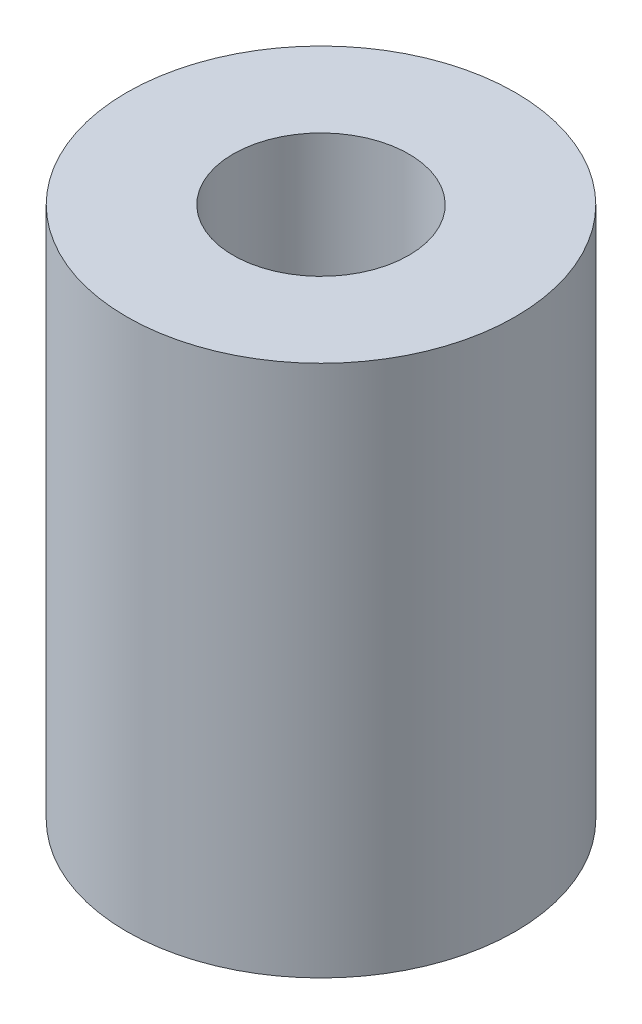
ISO-10303-21;
HEADER;
FILE_DESCRIPTION(('STEP AP214'),'2;1');
FILE_NAME('part.step','',(''),(''),'','','');
FILE_SCHEMA(('AUTOMOTIVE_DESIGN { 1 0 10303 214 1 1 1 1 }'));
ENDSEC;
DATA;
#1=APPLICATION_CONTEXT('core data for automotive mechanical design processes');
#2=APPLICATION_PROTOCOL_DEFINITION('international standard','automotive_design',2000,#1);
#3=PRODUCT_CONTEXT('',#1,'mechanical');
#4=PRODUCT('Part','Part','',(#3));
#5=PRODUCT_RELATED_PRODUCT_CATEGORY('part','',(#4));
#6=PRODUCT_DEFINITION_FORMATION('','',#4);
#7=PRODUCT_DEFINITION_CONTEXT('part definition',#1,'design');
#8=PRODUCT_DEFINITION('design','',#6,#7);
#9=PRODUCT_DEFINITION_SHAPE('','',#8);
#10=(LENGTH_UNIT() NAMED_UNIT(*) SI_UNIT(.MILLI.,.METRE.));
#11=(NAMED_UNIT(*) PLANE_ANGLE_UNIT() SI_UNIT($,.RADIAN.));
#12=(NAMED_UNIT(*) SI_UNIT($,.STERADIAN.) SOLID_ANGLE_UNIT());
#13=UNCERTAINTY_MEASURE_WITH_UNIT(LENGTH_MEASURE(1.E-05),#10,'distance_accuracy_value','');
#14=(GEOMETRIC_REPRESENTATION_CONTEXT(3) GLOBAL_UNCERTAINTY_ASSIGNED_CONTEXT((#13)) GLOBAL_UNIT_ASSIGNED_CONTEXT((#10,
#11,#12)) REPRESENTATION_CONTEXT('',''));
#15=CARTESIAN_POINT('',(0.,0.,0.));
#16=DIRECTION('',(0.,0.,1.));
#17=DIRECTION('',(1.,0.,0.));
#18=AXIS2_PLACEMENT_3D('',#15,#16,#17);
#19=CARTESIAN_POINT('',(0.,10.,0.));
#20=DIRECTION('',(0.,1.,0.));
#21=DIRECTION('',(-1.,0.,0.));
#22=AXIS2_PLACEMENT_3D('',#19,#20,#21);
#23=CYLINDRICAL_SURFACE('',#22,4.125);
#24=CARTESIAN_POINT('',(0.,0.,0.));
#25=DIRECTION('',(0.,1.,0.));
#26=DIRECTION('',(-1.,0.,0.));
#27=AXIS2_PLACEMENT_3D('',#24,#25,#26);
#28=CIRCLE('',#27,4.125);
#29=CARTESIAN_POINT('',(-4.125,0.,0.));
#30=VERTEX_POINT('',#29);
#31=EDGE_CURVE('E53',#30,#30,#28,.T.);
#32=ORIENTED_EDGE('',*,*,#31,.F.);
#33=EDGE_LOOP('',(#32));
#34=FACE_BOUND('',#33,.T.);
#35=CARTESIAN_POINT('',(0.,10.,0.));
#36=DIRECTION('',(0.,1.,0.));
#37=DIRECTION('',(-1.,0.,0.));
#38=AXIS2_PLACEMENT_3D('',#35,#36,#37);
#39=CIRCLE('',#38,4.125);
#40=CARTESIAN_POINT('',(-4.125,10.,0.));
#41=VERTEX_POINT('',#40);
#42=EDGE_CURVE('E10',#41,#41,#39,.T.);
#43=ORIENTED_EDGE('',*,*,#42,.T.);
#44=EDGE_LOOP('',(#43));
#45=FACE_BOUND('',#44,.T.);
#46=ADVANCED_FACE('F31',(#34,#45),#23,.F.);
#47=CARTESIAN_POINT('',(4.125,10.,0.));
#48=DIRECTION('',(0.,-1.,0.));
#49=DIRECTION('',(1.,0.,0.));
#50=AXIS2_PLACEMENT_3D('',#47,#48,#49);
#51=PLANE('',#50);
#52=ORIENTED_EDGE('',*,*,#42,.F.);
#53=EDGE_LOOP('',(#52));
#54=FACE_BOUND('',#53,.T.);
#55=CARTESIAN_POINT('',(0.,10.,0.));
#56=DIRECTION('',(0.,1.,0.));
#57=DIRECTION('',(-1.,0.,0.));
#58=AXIS2_PLACEMENT_3D('',#55,#56,#57);
#59=CIRCLE('',#58,9.125);
#60=CARTESIAN_POINT('',(-9.125,10.,0.));
#61=VERTEX_POINT('',#60);
#62=EDGE_CURVE('E37',#61,#61,#59,.T.);
#63=ORIENTED_EDGE('',*,*,#62,.T.);
#64=EDGE_LOOP('',(#63));
#65=FACE_BOUND('',#64,.T.);
#66=ADVANCED_FACE('F60',(#54,#65),#51,.F.);
#67=CARTESIAN_POINT('',(0.,10.,0.));
#68=DIRECTION('',(0.,1.,0.));
#69=DIRECTION('',(-1.,0.,0.));
#70=AXIS2_PLACEMENT_3D('',#67,#68,#69);
#71=CYLINDRICAL_SURFACE('',#70,9.125);
#72=ORIENTED_EDGE('',*,*,#62,.F.);
#73=EDGE_LOOP('',(#72));
#74=FACE_BOUND('',#73,.T.);
#75=CARTESIAN_POINT('',(0.,-15.,0.));
#76=DIRECTION('',(0.,1.,0.));
#77=DIRECTION('',(-1.,0.,0.));
#78=AXIS2_PLACEMENT_3D('',#75,#76,#77);
#79=CIRCLE('',#78,9.125);
#80=CARTESIAN_POINT('',(-9.125,-15.,0.));
#81=VERTEX_POINT('',#80);
#82=EDGE_CURVE('E41',#81,#81,#79,.T.);
#83=ORIENTED_EDGE('',*,*,#82,.T.);
#84=EDGE_LOOP('',(#83));
#85=FACE_BOUND('',#84,.T.);
#86=ADVANCED_FACE('F64',(#74,#85),#71,.T.);
#87=CARTESIAN_POINT('',(9.12500000000001,-15.,0.));
#88=DIRECTION('',(0.,1.,0.));
#89=DIRECTION('',(-1.,0.,0.));
#90=AXIS2_PLACEMENT_3D('',#87,#88,#89);
#91=PLANE('',#90);
#92=ORIENTED_EDGE('',*,*,#82,.F.);
#93=EDGE_LOOP('',(#92));
#94=FACE_BOUND('',#93,.T.);
#95=CARTESIAN_POINT('',(0.,-15.,0.));
#96=DIRECTION('',(0.,1.,0.));
#97=DIRECTION('',(-1.,0.,0.));
#98=AXIS2_PLACEMENT_3D('',#95,#96,#97);
#99=CIRCLE('',#98,1.5);
#100=CARTESIAN_POINT('',(-1.5,-15.,0.));
#101=VERTEX_POINT('',#100);
#102=EDGE_CURVE('E45',#101,#101,#99,.T.);
#103=ORIENTED_EDGE('',*,*,#102,.T.);
#104=EDGE_LOOP('',(#103));
#105=FACE_BOUND('',#104,.T.);
#106=ADVANCED_FACE('F69',(#94,#105),#91,.F.);
#107=CARTESIAN_POINT('',(0.,10.,0.));
#108=DIRECTION('',(0.,1.,0.));
#109=DIRECTION('',(-1.,0.,0.));
#110=AXIS2_PLACEMENT_3D('',#107,#108,#109);
#111=CYLINDRICAL_SURFACE('',#110,1.5);
#112=ORIENTED_EDGE('',*,*,#102,.F.);
#113=EDGE_LOOP('',(#112));
#114=FACE_BOUND('',#113,.T.);
#115=CARTESIAN_POINT('',(0.,0.,0.));
#116=DIRECTION('',(0.,1.,0.));
#117=DIRECTION('',(-1.,0.,0.));
#118=AXIS2_PLACEMENT_3D('',#115,#116,#117);
#119=CIRCLE('',#118,1.5);
#120=CARTESIAN_POINT('',(-1.5,0.,0.));
#121=VERTEX_POINT('',#120);
#122=EDGE_CURVE('E50',#121,#121,#119,.T.);
#123=ORIENTED_EDGE('',*,*,#122,.T.);
#124=EDGE_LOOP('',(#123));
#125=FACE_BOUND('',#124,.T.);
#126=ADVANCED_FACE('F75',(#114,#125),#111,.F.);
#127=CARTESIAN_POINT('',(1.5,0.,0.));
#128=DIRECTION('',(0.,-1.,0.));
#129=DIRECTION('',(1.,0.,0.));
#130=AXIS2_PLACEMENT_3D('',#127,#128,#129);
#131=PLANE('',#130);
#132=ORIENTED_EDGE('',*,*,#122,.F.);
#133=EDGE_LOOP('',(#132));
#134=FACE_BOUND('',#133,.T.);
#135=ORIENTED_EDGE('',*,*,#31,.T.);
#136=EDGE_LOOP('',(#135));
#137=FACE_BOUND('',#136,.T.);
#138=ADVANCED_FACE('F57',(#134,#137),#131,.F.);
#139=CLOSED_SHELL('',(#46,#66,#86,#106,#126,#138));
#140=MANIFOLD_SOLID_BREP('B2',#139);
#141=ADVANCED_BREP_SHAPE_REPRESENTATION('',(#18,#140),#14);
#142=SHAPE_DEFINITION_REPRESENTATION(#9,#141);
ENDSEC;
END-ISO-10303-21;
